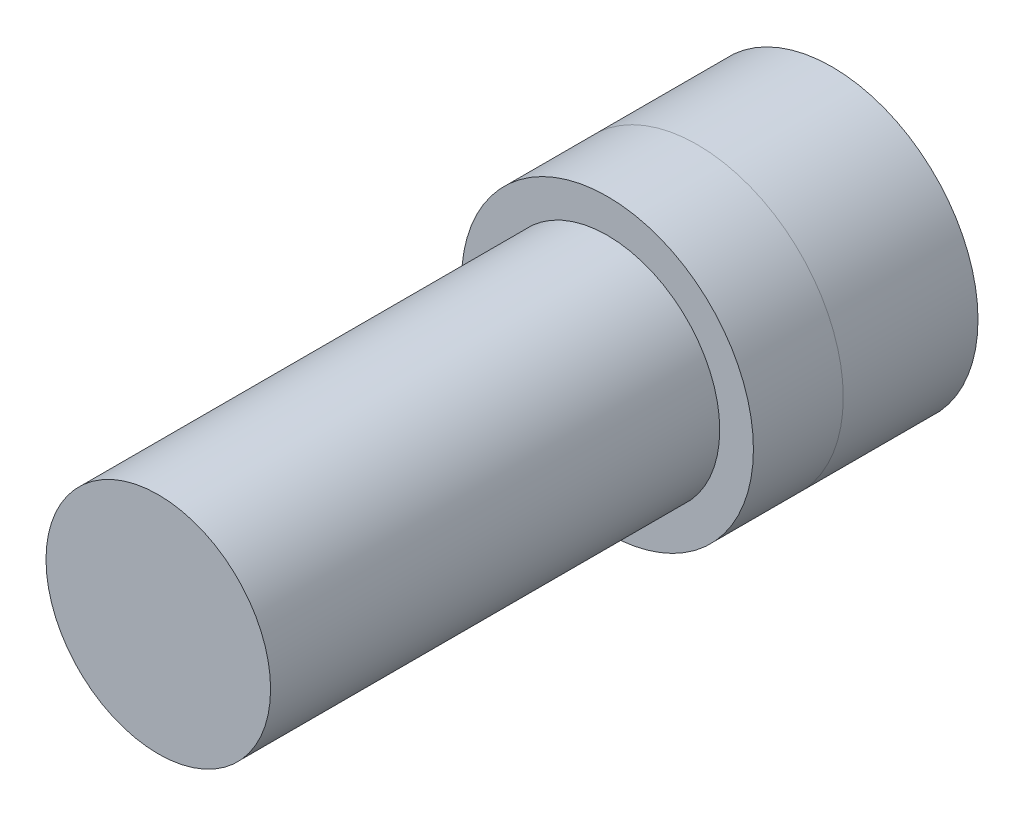
ISO-10303-21;
HEADER;
FILE_DESCRIPTION(('STEP AP214'),'2;1');
FILE_NAME('part.step','',(''),(''),'','','');
FILE_SCHEMA(('AUTOMOTIVE_DESIGN { 1 0 10303 214 1 1 1 1 }'));
ENDSEC;
DATA;
#1=APPLICATION_CONTEXT('core data for automotive mechanical design processes');
#2=APPLICATION_PROTOCOL_DEFINITION('international standard','automotive_design',2000,#1);
#3=PRODUCT_CONTEXT('',#1,'mechanical');
#4=PRODUCT('Part','Part','',(#3));
#5=PRODUCT_RELATED_PRODUCT_CATEGORY('part','',(#4));
#6=PRODUCT_DEFINITION_FORMATION('','',#4);
#7=PRODUCT_DEFINITION_CONTEXT('part definition',#1,'design');
#8=PRODUCT_DEFINITION('design','',#6,#7);
#9=PRODUCT_DEFINITION_SHAPE('','',#8);
#10=(LENGTH_UNIT() NAMED_UNIT(*) SI_UNIT(.MILLI.,.METRE.));
#11=(NAMED_UNIT(*) PLANE_ANGLE_UNIT() SI_UNIT($,.RADIAN.));
#12=(NAMED_UNIT(*) SI_UNIT($,.STERADIAN.) SOLID_ANGLE_UNIT());
#13=UNCERTAINTY_MEASURE_WITH_UNIT(LENGTH_MEASURE(1.E-05),#10,'distance_accuracy_value','');
#14=(GEOMETRIC_REPRESENTATION_CONTEXT(3) GLOBAL_UNCERTAINTY_ASSIGNED_CONTEXT((#13)) GLOBAL_UNIT_ASSIGNED_CONTEXT((#10,
#11,#12)) REPRESENTATION_CONTEXT('',''));
#15=CARTESIAN_POINT('',(0.,0.,0.));
#16=DIRECTION('',(0.,0.,1.));
#17=DIRECTION('',(1.,0.,0.));
#18=AXIS2_PLACEMENT_3D('',#15,#16,#17);
#19=CARTESIAN_POINT('',(0.,0.,0.));
#20=DIRECTION('',(0.,0.,1.));
#21=DIRECTION('',(1.,0.,0.));
#22=AXIS2_PLACEMENT_3D('',#19,#20,#21);
#23=CYLINDRICAL_SURFACE('',#22,6.5);
#24=CARTESIAN_POINT('',(0.,0.,0.));
#25=DIRECTION('',(0.,0.,-1.));
#26=DIRECTION('',(-1.,0.,0.));
#27=AXIS2_PLACEMENT_3D('',#24,#25,#26);
#28=CIRCLE('',#27,6.5);
#29=CARTESIAN_POINT('',(-6.5,0.,0.));
#30=VERTEX_POINT('',#29);
#31=EDGE_CURVE('E11',#30,#30,#28,.T.);
#32=ORIENTED_EDGE('',*,*,#31,.F.);
#33=EDGE_LOOP('',(#32));
#34=FACE_BOUND('',#33,.T.);
#35=CARTESIAN_POINT('',(0.,0.,6.));
#36=DIRECTION('',(0.,0.,-1.));
#37=DIRECTION('',(-1.,0.,0.));
#38=AXIS2_PLACEMENT_3D('',#35,#36,#37);
#39=CIRCLE('',#38,6.5);
#40=CARTESIAN_POINT('',(-6.5,0.,6.));
#41=VERTEX_POINT('',#40);
#42=EDGE_CURVE('E40',#41,#41,#39,.T.);
#43=ORIENTED_EDGE('',*,*,#42,.T.);
#44=EDGE_LOOP('',(#43));
#45=FACE_BOUND('',#44,.T.);
#46=ADVANCED_FACE('F37',(#34,#45),#23,.T.);
#47=CARTESIAN_POINT('',(0.,0.,0.));
#48=DIRECTION('',(0.,0.,-1.));
#49=DIRECTION('',(-1.,0.,0.));
#50=AXIS2_PLACEMENT_3D('',#47,#48,#49);
#51=PLANE('',#50);
#52=ORIENTED_EDGE('',*,*,#31,.T.);
#53=EDGE_LOOP('',(#52));
#54=FACE_BOUND('',#53,.T.);
#55=ADVANCED_FACE('F52',(#54),#51,.T.);
#56=CARTESIAN_POINT('',(0.,0.,6.));
#57=DIRECTION('',(0.,0.,-1.));
#58=DIRECTION('',(-1.,0.,0.));
#59=AXIS2_PLACEMENT_3D('',#56,#57,#58);
#60=PLANE('',#59);
#61=ORIENTED_EDGE('',*,*,#42,.F.);
#62=EDGE_LOOP('',(#61));
#63=FACE_BOUND('',#62,.T.);
#64=ADVANCED_FACE('F50',(#63),#60,.F.);
#65=CLOSED_SHELL('',(#46,#55,#64));
#66=MANIFOLD_SOLID_BREP('B2',#65);
#67=CARTESIAN_POINT('',(0.,0.,10.));
#68=DIRECTION('',(0.,0.,-1.));
#69=DIRECTION('',(-1.,0.,0.));
#70=AXIS2_PLACEMENT_3D('',#67,#68,#69);
#71=CYLINDRICAL_SURFACE('',#70,6.5);
#72=CARTESIAN_POINT('',(0.,0.,10.));
#73=DIRECTION('',(0.,0.,1.));
#74=DIRECTION('',(1.,0.,0.));
#75=AXIS2_PLACEMENT_3D('',#72,#73,#74);
#76=CIRCLE('',#75,6.5);
#77=CARTESIAN_POINT('',(6.5,0.,10.));
#78=VERTEX_POINT('',#77);
#79=EDGE_CURVE('E36',#78,#78,#76,.T.);
#80=ORIENTED_EDGE('',*,*,#79,.F.);
#81=EDGE_LOOP('',(#80));
#82=FACE_BOUND('',#81,.T.);
#83=CARTESIAN_POINT('',(0.,0.,6.));
#84=DIRECTION('',(0.,0.,-1.));
#85=DIRECTION('',(-1.,0.,0.));
#86=AXIS2_PLACEMENT_3D('',#83,#84,#85);
#87=CIRCLE('',#86,6.5);
#88=CARTESIAN_POINT('',(-6.5,0.,6.));
#89=VERTEX_POINT('',#88);
#90=EDGE_CURVE('E93',#89,#89,#87,.T.);
#91=ORIENTED_EDGE('',*,*,#90,.F.);
#92=EDGE_LOOP('',(#91));
#93=FACE_BOUND('',#92,.T.);
#94=ADVANCED_FACE('F78',(#82,#93),#71,.T.);
#95=CARTESIAN_POINT('',(0.,0.,10.));
#96=DIRECTION('',(0.,0.,1.));
#97=DIRECTION('',(1.,0.,0.));
#98=AXIS2_PLACEMENT_3D('',#95,#96,#97);
#99=PLANE('',#98);
#100=ORIENTED_EDGE('',*,*,#79,.T.);
#101=EDGE_LOOP('',(#100));
#102=FACE_BOUND('',#101,.T.);
#103=CARTESIAN_POINT('',(0.,0.,10.));
#104=DIRECTION('',(0.,0.,1.));
#105=DIRECTION('',(1.,0.,0.));
#106=AXIS2_PLACEMENT_3D('',#103,#104,#105);
#107=CIRCLE('',#106,5.);
#108=CARTESIAN_POINT('',(5.,0.,10.));
#109=VERTEX_POINT('',#108);
#110=EDGE_CURVE('E88',#109,#109,#107,.T.);
#111=ORIENTED_EDGE('',*,*,#110,.F.);
#112=EDGE_LOOP('',(#111));
#113=FACE_BOUND('',#112,.T.);
#114=ADVANCED_FACE('F101',(#102,#113),#99,.T.);
#115=CARTESIAN_POINT('',(0.,0.,30.));
#116=DIRECTION('',(0.,0.,-1.));
#117=DIRECTION('',(-1.,0.,0.));
#118=AXIS2_PLACEMENT_3D('',#115,#116,#117);
#119=CYLINDRICAL_SURFACE('',#118,5.);
#120=CARTESIAN_POINT('',(0.,0.,30.));
#121=DIRECTION('',(0.,0.,1.));
#122=DIRECTION('',(1.,0.,0.));
#123=AXIS2_PLACEMENT_3D('',#120,#121,#122);
#124=CIRCLE('',#123,5.);
#125=CARTESIAN_POINT('',(5.,0.,30.));
#126=VERTEX_POINT('',#125);
#127=EDGE_CURVE('E84',#126,#126,#124,.T.);
#128=ORIENTED_EDGE('',*,*,#127,.F.);
#129=EDGE_LOOP('',(#128));
#130=FACE_BOUND('',#129,.T.);
#131=ORIENTED_EDGE('',*,*,#110,.T.);
#132=EDGE_LOOP('',(#131));
#133=FACE_BOUND('',#132,.T.);
#134=ADVANCED_FACE('F106',(#130,#133),#119,.T.);
#135=CARTESIAN_POINT('',(0.,0.,30.));
#136=DIRECTION('',(0.,0.,1.));
#137=DIRECTION('',(1.,0.,0.));
#138=AXIS2_PLACEMENT_3D('',#135,#136,#137);
#139=PLANE('',#138);
#140=ORIENTED_EDGE('',*,*,#127,.T.);
#141=EDGE_LOOP('',(#140));
#142=FACE_BOUND('',#141,.T.);
#143=ADVANCED_FACE('F110',(#142),#139,.T.);
#144=CARTESIAN_POINT('',(0.,0.,6.));
#145=DIRECTION('',(0.,0.,-1.));
#146=DIRECTION('',(-1.,0.,0.));
#147=AXIS2_PLACEMENT_3D('',#144,#145,#146);
#148=PLANE('',#147);
#149=ORIENTED_EDGE('',*,*,#90,.T.);
#150=EDGE_LOOP('',(#149));
#151=FACE_BOUND('',#150,.T.);
#152=ADVANCED_FACE('F98',(#151),#148,.T.);
#153=CLOSED_SHELL('',(#94,#114,#134,#143,#152));
#154=MANIFOLD_SOLID_BREP('B6',#153);
#155=ADVANCED_BREP_SHAPE_REPRESENTATION('',(#18,#66,#154),#14);
#156=SHAPE_DEFINITION_REPRESENTATION(#9,#155);
ENDSEC;
END-ISO-10303-21;
